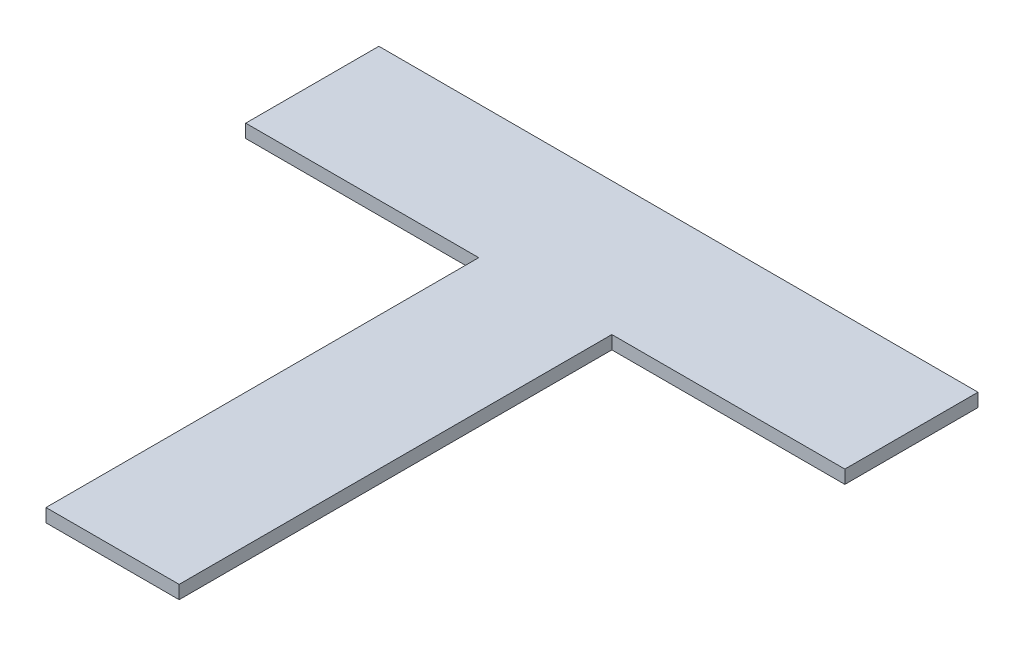
ISO-10303-21;
HEADER;
FILE_DESCRIPTION(('STEP AP214'),'2;1');
FILE_NAME('part.step','',(''),(''),'','','');
FILE_SCHEMA(('AUTOMOTIVE_DESIGN { 1 0 10303 214 1 1 1 1 }'));
ENDSEC;
DATA;
#1=APPLICATION_CONTEXT('core data for automotive mechanical design processes');
#2=APPLICATION_PROTOCOL_DEFINITION('international standard','automotive_design',2000,#1);
#3=PRODUCT_CONTEXT('',#1,'mechanical');
#4=PRODUCT('Part','Part','',(#3));
#5=PRODUCT_RELATED_PRODUCT_CATEGORY('part','',(#4));
#6=PRODUCT_DEFINITION_FORMATION('','',#4);
#7=PRODUCT_DEFINITION_CONTEXT('part definition',#1,'design');
#8=PRODUCT_DEFINITION('design','',#6,#7);
#9=PRODUCT_DEFINITION_SHAPE('','',#8);
#10=(LENGTH_UNIT() NAMED_UNIT(*) SI_UNIT(.MILLI.,.METRE.));
#11=(NAMED_UNIT(*) PLANE_ANGLE_UNIT() SI_UNIT($,.RADIAN.));
#12=(NAMED_UNIT(*) SI_UNIT($,.STERADIAN.) SOLID_ANGLE_UNIT());
#13=UNCERTAINTY_MEASURE_WITH_UNIT(LENGTH_MEASURE(1.E-05),#10,'distance_accuracy_value','');
#14=(GEOMETRIC_REPRESENTATION_CONTEXT(3) GLOBAL_UNCERTAINTY_ASSIGNED_CONTEXT((#13)) GLOBAL_UNIT_ASSIGNED_CONTEXT((#10,
#11,#12)) REPRESENTATION_CONTEXT('',''));
#15=CARTESIAN_POINT('',(0.,0.,0.));
#16=DIRECTION('',(0.,0.,1.));
#17=DIRECTION('',(1.,0.,0.));
#18=AXIS2_PLACEMENT_3D('',#15,#16,#17);
#19=CARTESIAN_POINT('',(-10.,2.,-22.5));
#20=DIRECTION('',(1.,0.,0.));
#21=DIRECTION('',(0.,0.,-1.));
#22=AXIS2_PLACEMENT_3D('',#19,#20,#21);
#23=PLANE('',#22);
#24=DIRECTION('',(0.,0.,1.));
#25=VECTOR('',#24,1.);
#26=CARTESIAN_POINT('',(-10.,0.,-22.5));
#27=LINE('',#26,#25);
#28=CARTESIAN_POINT('',(-10.,0.,-22.5));
#29=VERTEX_POINT('',#28);
#30=CARTESIAN_POINT('',(-9.99999999999999,0.,42.5));
#31=VERTEX_POINT('',#30);
#32=EDGE_CURVE('E128',#29,#31,#27,.T.);
#33=ORIENTED_EDGE('',*,*,#32,.T.);
#34=DIRECTION('',(0.,-1.,0.));
#35=VECTOR('',#34,1.);
#36=CARTESIAN_POINT('',(-9.99999999999999,2.,42.5));
#37=LINE('',#36,#35);
#38=CARTESIAN_POINT('',(-9.99999999999999,2.,42.5));
#39=VERTEX_POINT('',#38);
#40=EDGE_CURVE('E11',#39,#31,#37,.T.);
#41=ORIENTED_EDGE('',*,*,#40,.F.);
#42=DIRECTION('',(0.,0.,1.));
#43=VECTOR('',#42,1.);
#44=CARTESIAN_POINT('',(-10.,2.,-22.5));
#45=LINE('',#44,#43);
#46=CARTESIAN_POINT('',(-10.,2.,-22.5));
#47=VERTEX_POINT('',#46);
#48=EDGE_CURVE('E49',#47,#39,#45,.T.);
#49=ORIENTED_EDGE('',*,*,#48,.F.);
#50=DIRECTION('',(0.,-1.,0.));
#51=VECTOR('',#50,1.);
#52=CARTESIAN_POINT('',(-10.,2.,-22.5));
#53=LINE('',#52,#51);
#54=EDGE_CURVE('E67',#47,#29,#53,.T.);
#55=ORIENTED_EDGE('',*,*,#54,.T.);
#56=EDGE_LOOP('',(#33,#41,#49,#55));
#57=FACE_BOUND('',#56,.T.);
#58=ADVANCED_FACE('F33',(#57),#23,.F.);
#59=CARTESIAN_POINT('',(-9.99999999999999,2.,42.5));
#60=DIRECTION('',(0.,0.,-1.));
#61=DIRECTION('',(-1.,0.,0.));
#62=AXIS2_PLACEMENT_3D('',#59,#60,#61);
#63=PLANE('',#62);
#64=DIRECTION('',(1.,0.,0.));
#65=VECTOR('',#64,1.);
#66=CARTESIAN_POINT('',(-9.99999999999999,0.,42.5));
#67=LINE('',#66,#65);
#68=CARTESIAN_POINT('',(10.,0.,42.5));
#69=VERTEX_POINT('',#68);
#70=EDGE_CURVE('E63',#31,#69,#67,.T.);
#71=ORIENTED_EDGE('',*,*,#70,.T.);
#72=DIRECTION('',(0.,-1.,0.));
#73=VECTOR('',#72,1.);
#74=CARTESIAN_POINT('',(10.,2.,42.5));
#75=LINE('',#74,#73);
#76=CARTESIAN_POINT('',(10.,2.,42.5));
#77=VERTEX_POINT('',#76);
#78=EDGE_CURVE('E41',#77,#69,#75,.T.);
#79=ORIENTED_EDGE('',*,*,#78,.F.);
#80=DIRECTION('',(1.,0.,0.));
#81=VECTOR('',#80,1.);
#82=CARTESIAN_POINT('',(-9.99999999999999,2.,42.5));
#83=LINE('',#82,#81);
#84=EDGE_CURVE('E72',#39,#77,#83,.T.);
#85=ORIENTED_EDGE('',*,*,#84,.F.);
#86=ORIENTED_EDGE('',*,*,#40,.T.);
#87=EDGE_LOOP('',(#71,#79,#85,#86));
#88=FACE_BOUND('',#87,.T.);
#89=ADVANCED_FACE('F186',(#88),#63,.F.);
#90=CARTESIAN_POINT('',(9.99999999999999,2.,-22.5));
#91=DIRECTION('',(-1.,0.,0.));
#92=DIRECTION('',(0.,0.,1.));
#93=AXIS2_PLACEMENT_3D('',#90,#91,#92);
#94=PLANE('',#93);
#95=DIRECTION('',(0.,0.,-1.));
#96=VECTOR('',#95,1.);
#97=CARTESIAN_POINT('',(9.99999999999999,0.,-22.5));
#98=LINE('',#97,#96);
#99=CARTESIAN_POINT('',(10.,0.,-22.5));
#100=VERTEX_POINT('',#99);
#101=EDGE_CURVE('E136',#69,#100,#98,.T.);
#102=ORIENTED_EDGE('',*,*,#101,.T.);
#103=DIRECTION('',(0.,-1.,0.));
#104=VECTOR('',#103,1.);
#105=CARTESIAN_POINT('',(9.99999999999999,2.,-22.5));
#106=LINE('',#105,#104);
#107=CARTESIAN_POINT('',(9.99999999999999,2.,-22.5));
#108=VERTEX_POINT('',#107);
#109=EDGE_CURVE('E143',#108,#100,#106,.T.);
#110=ORIENTED_EDGE('',*,*,#109,.F.);
#111=DIRECTION('',(0.,0.,-1.));
#112=VECTOR('',#111,1.);
#113=CARTESIAN_POINT('',(9.99999999999999,2.,-22.5));
#114=LINE('',#113,#112);
#115=EDGE_CURVE('E138',#77,#108,#114,.T.);
#116=ORIENTED_EDGE('',*,*,#115,.F.);
#117=ORIENTED_EDGE('',*,*,#78,.T.);
#118=EDGE_LOOP('',(#102,#110,#116,#117));
#119=FACE_BOUND('',#118,.T.);
#120=ADVANCED_FACE('F148',(#119),#94,.F.);
#121=CARTESIAN_POINT('',(0.,2.,0.));
#122=DIRECTION('',(0.,1.,0.));
#123=DIRECTION('',(0.,0.,1.));
#124=AXIS2_PLACEMENT_3D('',#121,#122,#123);
#125=PLANE('',#124);
#126=ORIENTED_EDGE('',*,*,#48,.T.);
#127=ORIENTED_EDGE('',*,*,#84,.T.);
#128=ORIENTED_EDGE('',*,*,#115,.T.);
#129=DIRECTION('',(1.,0.,0.));
#130=VECTOR('',#129,1.);
#131=CARTESIAN_POINT('',(45.,1.99999999999999,-22.5));
#132=LINE('',#131,#130);
#133=CARTESIAN_POINT('',(45.,1.99999999999999,-22.5));
#134=VERTEX_POINT('',#133);
#135=EDGE_CURVE('E155',#108,#134,#132,.T.);
#136=ORIENTED_EDGE('',*,*,#135,.T.);
#137=DIRECTION('',(0.,0.,1.));
#138=VECTOR('',#137,1.);
#139=CARTESIAN_POINT('',(45.,1.99999999999999,-42.5));
#140=LINE('',#139,#138);
#141=CARTESIAN_POINT('',(45.,1.99999999999999,-42.5));
#142=VERTEX_POINT('',#141);
#143=EDGE_CURVE('E162',#142,#134,#140,.T.);
#144=ORIENTED_EDGE('',*,*,#143,.F.);
#145=DIRECTION('',(1.,0.,0.));
#146=VECTOR('',#145,1.);
#147=CARTESIAN_POINT('',(45.,1.99999999999999,-42.5));
#148=LINE('',#147,#146);
#149=CARTESIAN_POINT('',(-45.,1.99999999999999,-42.5));
#150=VERTEX_POINT('',#149);
#151=EDGE_CURVE('E119',#150,#142,#148,.T.);
#152=ORIENTED_EDGE('',*,*,#151,.F.);
#153=DIRECTION('',(0.,0.,1.));
#154=VECTOR('',#153,1.);
#155=CARTESIAN_POINT('',(-45.,1.99999999999999,-42.5));
#156=LINE('',#155,#154);
#157=CARTESIAN_POINT('',(-45.,1.99999999999999,-22.5));
#158=VERTEX_POINT('',#157);
#159=EDGE_CURVE('E131',#150,#158,#156,.T.);
#160=ORIENTED_EDGE('',*,*,#159,.T.);
#161=EDGE_CURVE('E123',#158,#47,#132,.T.);
#162=ORIENTED_EDGE('',*,*,#161,.T.);
#163=EDGE_LOOP('',(#126,#127,#128,#136,#144,#152,#160,#162));
#164=FACE_BOUND('',#163,.T.);
#165=ADVANCED_FACE('F167',(#164),#125,.T.);
#166=CARTESIAN_POINT('',(0.,0.,0.));
#167=DIRECTION('',(0.,1.,0.));
#168=DIRECTION('',(0.,0.,1.));
#169=AXIS2_PLACEMENT_3D('',#166,#167,#168);
#170=PLANE('',#169);
#171=ORIENTED_EDGE('',*,*,#32,.F.);
#172=DIRECTION('',(-1.,0.,0.));
#173=VECTOR('',#172,1.);
#174=CARTESIAN_POINT('',(45.,0.,-22.5));
#175=LINE('',#174,#173);
#176=CARTESIAN_POINT('',(-45.,0.,-22.5));
#177=VERTEX_POINT('',#176);
#178=EDGE_CURVE('E153',#29,#177,#175,.T.);
#179=ORIENTED_EDGE('',*,*,#178,.T.);
#180=DIRECTION('',(0.,0.,1.));
#181=VECTOR('',#180,1.);
#182=CARTESIAN_POINT('',(-45.,0.,-42.5));
#183=LINE('',#182,#181);
#184=CARTESIAN_POINT('',(-45.,0.,-42.5));
#185=VERTEX_POINT('',#184);
#186=EDGE_CURVE('E110',#185,#177,#183,.T.);
#187=ORIENTED_EDGE('',*,*,#186,.F.);
#188=DIRECTION('',(-1.,0.,0.));
#189=VECTOR('',#188,1.);
#190=CARTESIAN_POINT('',(45.,0.,-42.5));
#191=LINE('',#190,#189);
#192=CARTESIAN_POINT('',(45.,0.,-42.5));
#193=VERTEX_POINT('',#192);
#194=EDGE_CURVE('E102',#193,#185,#191,.T.);
#195=ORIENTED_EDGE('',*,*,#194,.F.);
#196=DIRECTION('',(0.,0.,1.));
#197=VECTOR('',#196,1.);
#198=CARTESIAN_POINT('',(45.,0.,-42.5));
#199=LINE('',#198,#197);
#200=CARTESIAN_POINT('',(45.,0.,-22.5));
#201=VERTEX_POINT('',#200);
#202=EDGE_CURVE('E107',#193,#201,#199,.T.);
#203=ORIENTED_EDGE('',*,*,#202,.T.);
#204=EDGE_CURVE('E150',#201,#100,#175,.T.);
#205=ORIENTED_EDGE('',*,*,#204,.T.);
#206=ORIENTED_EDGE('',*,*,#101,.F.);
#207=ORIENTED_EDGE('',*,*,#70,.F.);
#208=EDGE_LOOP('',(#171,#179,#187,#195,#203,#205,#206,#207));
#209=FACE_BOUND('',#208,.T.);
#210=ADVANCED_FACE('F104',(#209),#170,.F.);
#211=CARTESIAN_POINT('',(0.,0.,-22.5));
#212=DIRECTION('',(0.,0.,-1.));
#213=DIRECTION('',(-1.,0.,0.));
#214=AXIS2_PLACEMENT_3D('',#211,#212,#213);
#215=PLANE('',#214);
#216=ORIENTED_EDGE('',*,*,#135,.F.);
#217=ORIENTED_EDGE('',*,*,#109,.T.);
#218=ORIENTED_EDGE('',*,*,#204,.F.);
#219=DIRECTION('',(0.,-1.,0.));
#220=VECTOR('',#219,1.);
#221=CARTESIAN_POINT('',(45.,1.99999999999999,-22.5));
#222=LINE('',#221,#220);
#223=EDGE_CURVE('E127',#134,#201,#222,.T.);
#224=ORIENTED_EDGE('',*,*,#223,.F.);
#225=EDGE_LOOP('',(#216,#217,#218,#224));
#226=FACE_BOUND('',#225,.T.);
#227=ADVANCED_FACE('F182',(#226),#215,.F.);
#228=CARTESIAN_POINT('',(45.,1.99999999999999,-42.5));
#229=DIRECTION('',(-1.,0.,0.));
#230=DIRECTION('',(0.,0.,1.));
#231=AXIS2_PLACEMENT_3D('',#228,#229,#230);
#232=PLANE('',#231);
#233=ORIENTED_EDGE('',*,*,#223,.T.);
#234=ORIENTED_EDGE('',*,*,#202,.F.);
#235=DIRECTION('',(0.,-1.,0.));
#236=VECTOR('',#235,1.);
#237=CARTESIAN_POINT('',(45.,1.99999999999999,-42.5));
#238=LINE('',#237,#236);
#239=EDGE_CURVE('E114',#142,#193,#238,.T.);
#240=ORIENTED_EDGE('',*,*,#239,.F.);
#241=ORIENTED_EDGE('',*,*,#143,.T.);
#242=EDGE_LOOP('',(#233,#234,#240,#241));
#243=FACE_BOUND('',#242,.T.);
#244=ADVANCED_FACE('F125',(#243),#232,.F.);
#245=CARTESIAN_POINT('',(-45.,1.99999999999999,-42.5));
#246=DIRECTION('',(1.,0.,0.));
#247=DIRECTION('',(0.,0.,-1.));
#248=AXIS2_PLACEMENT_3D('',#245,#246,#247);
#249=PLANE('',#248);
#250=DIRECTION('',(0.,1.,0.));
#251=VECTOR('',#250,1.);
#252=CARTESIAN_POINT('',(-45.,1.99999999999999,-22.5));
#253=LINE('',#252,#251);
#254=EDGE_CURVE('E152',#177,#158,#253,.T.);
#255=ORIENTED_EDGE('',*,*,#254,.T.);
#256=ORIENTED_EDGE('',*,*,#159,.F.);
#257=DIRECTION('',(0.,1.,0.));
#258=VECTOR('',#257,1.);
#259=CARTESIAN_POINT('',(-45.,1.99999999999999,-42.5));
#260=LINE('',#259,#258);
#261=EDGE_CURVE('E113',#185,#150,#260,.T.);
#262=ORIENTED_EDGE('',*,*,#261,.F.);
#263=ORIENTED_EDGE('',*,*,#186,.T.);
#264=EDGE_LOOP('',(#255,#256,#262,#263));
#265=FACE_BOUND('',#264,.T.);
#266=ADVANCED_FACE('F173',(#265),#249,.F.);
#267=CARTESIAN_POINT('',(0.,0.,-42.5));
#268=DIRECTION('',(0.,0.,-1.));
#269=DIRECTION('',(-1.,0.,0.));
#270=AXIS2_PLACEMENT_3D('',#267,#268,#269);
#271=PLANE('',#270);
#272=ORIENTED_EDGE('',*,*,#239,.T.);
#273=ORIENTED_EDGE('',*,*,#194,.T.);
#274=ORIENTED_EDGE('',*,*,#261,.T.);
#275=ORIENTED_EDGE('',*,*,#151,.T.);
#276=EDGE_LOOP('',(#272,#273,#274,#275));
#277=FACE_BOUND('',#276,.T.);
#278=ADVANCED_FACE('F117',(#277),#271,.T.);
#279=ORIENTED_EDGE('',*,*,#54,.F.);
#280=ORIENTED_EDGE('',*,*,#161,.F.);
#281=ORIENTED_EDGE('',*,*,#254,.F.);
#282=ORIENTED_EDGE('',*,*,#178,.F.);
#283=EDGE_LOOP('',(#279,#280,#281,#282));
#284=FACE_BOUND('',#283,.T.);
#285=ADVANCED_FACE('F171',(#284),#215,.F.);
#286=CLOSED_SHELL('',(#58,#89,#120,#165,#210,#227,#244,#266,#278,#285));
#287=MANIFOLD_SOLID_BREP('B2',#286);
#288=ADVANCED_BREP_SHAPE_REPRESENTATION('',(#18,#287),#14);
#289=SHAPE_DEFINITION_REPRESENTATION(#9,#288);
ENDSEC;
END-ISO-10303-21;
